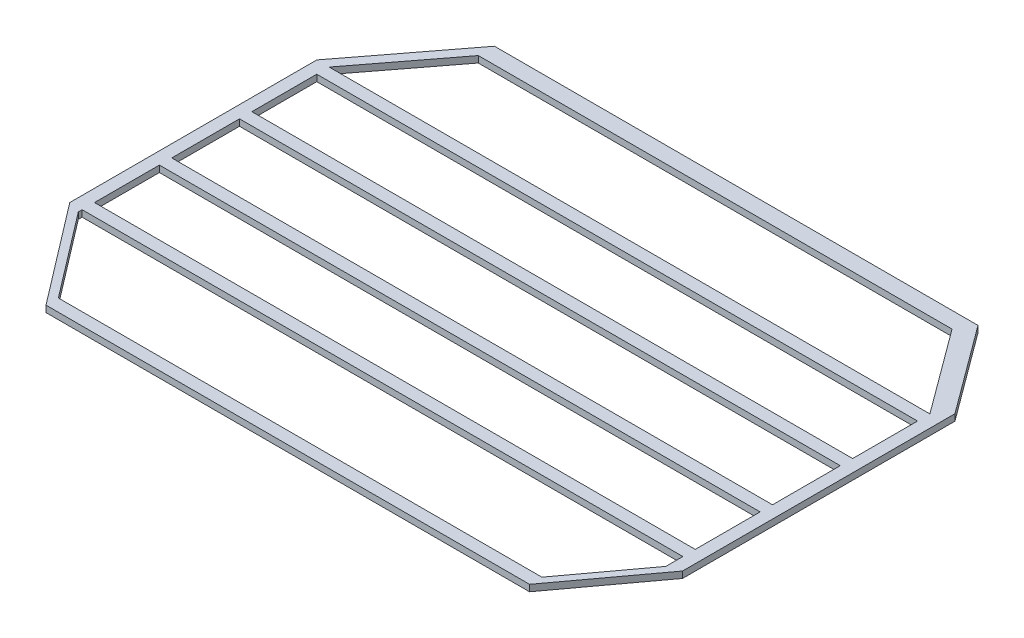
ISO-10303-21;
HEADER;
FILE_DESCRIPTION(('STEP AP214'),'2;1');
FILE_NAME('part.step','',(''),(''),'','','');
FILE_SCHEMA(('AUTOMOTIVE_DESIGN { 1 0 10303 214 1 1 1 1 }'));
ENDSEC;
DATA;
#1=APPLICATION_CONTEXT('core data for automotive mechanical design processes');
#2=APPLICATION_PROTOCOL_DEFINITION('international standard','automotive_design',2000,#1);
#3=PRODUCT_CONTEXT('',#1,'mechanical');
#4=PRODUCT('Part','Part','',(#3));
#5=PRODUCT_RELATED_PRODUCT_CATEGORY('part','',(#4));
#6=PRODUCT_DEFINITION_FORMATION('','',#4);
#7=PRODUCT_DEFINITION_CONTEXT('part definition',#1,'design');
#8=PRODUCT_DEFINITION('design','',#6,#7);
#9=PRODUCT_DEFINITION_SHAPE('','',#8);
#10=(LENGTH_UNIT() NAMED_UNIT(*) SI_UNIT(.MILLI.,.METRE.));
#11=(NAMED_UNIT(*) PLANE_ANGLE_UNIT() SI_UNIT($,.RADIAN.));
#12=(NAMED_UNIT(*) SI_UNIT($,.STERADIAN.) SOLID_ANGLE_UNIT());
#13=UNCERTAINTY_MEASURE_WITH_UNIT(LENGTH_MEASURE(1.E-05),#10,'distance_accuracy_value','');
#14=(GEOMETRIC_REPRESENTATION_CONTEXT(3) GLOBAL_UNCERTAINTY_ASSIGNED_CONTEXT((#13)) GLOBAL_UNIT_ASSIGNED_CONTEXT((#10,
#11,#12)) REPRESENTATION_CONTEXT('',''));
#15=CARTESIAN_POINT('',(0.,0.,0.));
#16=DIRECTION('',(0.,0.,1.));
#17=DIRECTION('',(1.,0.,0.));
#18=AXIS2_PLACEMENT_3D('',#15,#16,#17);
#19=CARTESIAN_POINT('',(19.05,0.,0.));
#20=DIRECTION('',(-1.,0.,0.));
#21=DIRECTION('',(0.,0.,1.));
#22=AXIS2_PLACEMENT_3D('',#19,#20,#21);
#23=PLANE('',#22);
#24=DIRECTION('',(0.,0.,1.));
#25=VECTOR('',#24,1.);
#26=CARTESIAN_POINT('',(19.05,10.,0.));
#27=LINE('',#26,#25);
#28=CARTESIAN_POINT('',(19.05,10.,-52.195));
#29=VERTEX_POINT('',#28);
#30=CARTESIAN_POINT('',(19.05,10.,52.195));
#31=VERTEX_POINT('',#30);
#32=EDGE_CURVE('E169',#29,#31,#27,.T.);
#33=ORIENTED_EDGE('',*,*,#32,.T.);
#34=DIRECTION('',(0.,1.,0.));
#35=VECTOR('',#34,1.);
#36=CARTESIAN_POINT('',(19.05,0.,52.195));
#37=LINE('',#36,#35);
#38=CARTESIAN_POINT('',(19.05,0.,52.195));
#39=VERTEX_POINT('',#38);
#40=EDGE_CURVE('E143',#39,#31,#37,.T.);
#41=ORIENTED_EDGE('',*,*,#40,.F.);
#42=DIRECTION('',(0.,0.,1.));
#43=VECTOR('',#42,1.);
#44=CARTESIAN_POINT('',(19.05,0.,0.));
#45=LINE('',#44,#43);
#46=CARTESIAN_POINT('',(19.05,0.,-52.195));
#47=VERTEX_POINT('',#46);
#48=EDGE_CURVE('E123',#47,#39,#45,.T.);
#49=ORIENTED_EDGE('',*,*,#48,.F.);
#50=DIRECTION('',(0.,1.,0.));
#51=VECTOR('',#50,1.);
#52=CARTESIAN_POINT('',(19.05,0.,-52.195));
#53=LINE('',#52,#51);
#54=EDGE_CURVE('E168',#47,#29,#53,.T.);
#55=ORIENTED_EDGE('',*,*,#54,.T.);
#56=EDGE_LOOP('',(#33,#41,#49,#55));
#57=FACE_BOUND('',#56,.T.);
#58=ADVANCED_FACE('F36',(#57),#23,.F.);
#59=CARTESIAN_POINT('',(0.,0.,-52.195));
#60=DIRECTION('',(0.,0.,1.));
#61=DIRECTION('',(1.,0.,0.));
#62=AXIS2_PLACEMENT_3D('',#59,#60,#61);
#63=PLANE('',#62);
#64=DIRECTION('',(1.,0.,0.));
#65=VECTOR('',#64,1.);
#66=CARTESIAN_POINT('',(0.,10.,-52.195));
#67=LINE('',#66,#65);
#68=CARTESIAN_POINT('',(944.66,10.,-52.195));
#69=VERTEX_POINT('',#68);
#70=EDGE_CURVE('E142',#29,#69,#67,.T.);
#71=ORIENTED_EDGE('',*,*,#70,.F.);
#72=ORIENTED_EDGE('',*,*,#54,.F.);
#73=DIRECTION('',(1.,0.,0.));
#74=VECTOR('',#73,1.);
#75=CARTESIAN_POINT('',(0.,0.,-52.195));
#76=LINE('',#75,#74);
#77=CARTESIAN_POINT('',(944.66,0.,-52.195));
#78=VERTEX_POINT('',#77);
#79=EDGE_CURVE('E164',#47,#78,#76,.T.);
#80=ORIENTED_EDGE('',*,*,#79,.T.);
#81=DIRECTION('',(0.,1.,0.));
#82=VECTOR('',#81,1.);
#83=CARTESIAN_POINT('',(944.66,0.,-52.195));
#84=LINE('',#83,#82);
#85=EDGE_CURVE('E167',#78,#69,#84,.T.);
#86=ORIENTED_EDGE('',*,*,#85,.T.);
#87=EDGE_LOOP('',(#71,#72,#80,#86));
#88=FACE_BOUND('',#87,.T.);
#89=ADVANCED_FACE('F519',(#88),#63,.T.);
#90=CARTESIAN_POINT('',(944.66,0.,0.));
#91=DIRECTION('',(1.,0.,0.));
#92=DIRECTION('',(0.,0.,-1.));
#93=AXIS2_PLACEMENT_3D('',#90,#91,#92);
#94=PLANE('',#93);
#95=DIRECTION('',(0.,0.,-1.));
#96=VECTOR('',#95,1.);
#97=CARTESIAN_POINT('',(944.66,10.,0.));
#98=LINE('',#97,#96);
#99=CARTESIAN_POINT('',(944.66,10.,52.195));
#100=VERTEX_POINT('',#99);
#101=EDGE_CURVE('E176',#100,#69,#98,.T.);
#102=ORIENTED_EDGE('',*,*,#101,.T.);
#103=ORIENTED_EDGE('',*,*,#85,.F.);
#104=DIRECTION('',(0.,0.,-1.));
#105=VECTOR('',#104,1.);
#106=CARTESIAN_POINT('',(944.66,0.,0.));
#107=LINE('',#106,#105);
#108=CARTESIAN_POINT('',(944.66,0.,52.195));
#109=VERTEX_POINT('',#108);
#110=EDGE_CURVE('E160',#109,#78,#107,.T.);
#111=ORIENTED_EDGE('',*,*,#110,.F.);
#112=DIRECTION('',(0.,1.,0.));
#113=VECTOR('',#112,1.);
#114=CARTESIAN_POINT('',(944.66,0.,52.195));
#115=LINE('',#114,#113);
#116=EDGE_CURVE('E175',#109,#100,#115,.T.);
#117=ORIENTED_EDGE('',*,*,#116,.T.);
#118=EDGE_LOOP('',(#102,#103,#111,#117));
#119=FACE_BOUND('',#118,.T.);
#120=ADVANCED_FACE('F524',(#119),#94,.F.);
#121=CARTESIAN_POINT('',(0.,0.,52.195));
#122=DIRECTION('',(0.,0.,1.));
#123=DIRECTION('',(1.,0.,0.));
#124=AXIS2_PLACEMENT_3D('',#121,#122,#123);
#125=PLANE('',#124);
#126=DIRECTION('',(1.,0.,0.));
#127=VECTOR('',#126,1.);
#128=CARTESIAN_POINT('',(0.,10.,52.195));
#129=LINE('',#128,#127);
#130=EDGE_CURVE('E172',#31,#100,#129,.T.);
#131=ORIENTED_EDGE('',*,*,#130,.T.);
#132=ORIENTED_EDGE('',*,*,#116,.F.);
#133=DIRECTION('',(1.,0.,0.));
#134=VECTOR('',#133,1.);
#135=CARTESIAN_POINT('',(0.,0.,52.195));
#136=LINE('',#135,#134);
#137=EDGE_CURVE('E157',#39,#109,#136,.T.);
#138=ORIENTED_EDGE('',*,*,#137,.F.);
#139=ORIENTED_EDGE('',*,*,#40,.T.);
#140=EDGE_LOOP('',(#131,#132,#138,#139));
#141=FACE_BOUND('',#140,.T.);
#142=ADVANCED_FACE('F528',(#141),#125,.F.);
#143=CARTESIAN_POINT('',(0.,10.,0.));
#144=DIRECTION('',(0.,1.,0.));
#145=DIRECTION('',(0.,0.,1.));
#146=AXIS2_PLACEMENT_3D('',#143,#144,#145);
#147=PLANE('',#146);
#148=DIRECTION('',(-1.,0.,0.));
#149=VECTOR('',#148,1.);
#150=CARTESIAN_POINT('',(0.,10.,-320.555846821165));
#151=LINE('',#150,#149);
#152=CARTESIAN_POINT('',(848.514252317726,10.,-320.555846821165));
#153=VERTEX_POINT('',#152);
#154=CARTESIAN_POINT('',(118.58,10.,-320.555846821165));
#155=VERTEX_POINT('',#154);
#156=EDGE_CURVE('E88',#153,#155,#151,.T.);
#157=ORIENTED_EDGE('',*,*,#156,.F.);
#158=DIRECTION('',(-0.593855643200284,0.,-0.804571609640296));
#159=VECTOR('',#158,1.);
#160=CARTESIAN_POINT('',(702.434764912067,10.,-518.468268237294));
#161=LINE('',#160,#159);
#162=CARTESIAN_POINT('',(944.66,10.,-190.295));
#163=VERTEX_POINT('',#162);
#164=EDGE_CURVE('E73',#163,#153,#161,.T.);
#165=ORIENTED_EDGE('',*,*,#164,.F.);
#166=DIRECTION('',(1.,0.,0.));
#167=VECTOR('',#166,1.);
#168=CARTESIAN_POINT('',(0.,10.,-190.295));
#169=LINE('',#168,#167);
#170=CARTESIAN_POINT('',(19.05,10.,-190.295));
#171=VERTEX_POINT('',#170);
#172=EDGE_CURVE('E78',#171,#163,#169,.T.);
#173=ORIENTED_EDGE('',*,*,#172,.F.);
#174=DIRECTION('',(-0.607137371358353,0.,0.794596886666484));
#175=VECTOR('',#174,1.);
#176=CARTESIAN_POINT('',(-79.7760458093183,10.,-60.9554600109612));
#177=LINE('',#176,#175);
#178=EDGE_CURVE('E46',#155,#171,#177,.T.);
#179=ORIENTED_EDGE('',*,*,#178,.F.);
#180=EDGE_LOOP('',(#157,#165,#173,#179));
#181=FACE_BOUND('',#180,.T.);
#182=DIRECTION('',(1.,0.,0.));
#183=VECTOR('',#182,1.);
#184=CARTESIAN_POINT('',(0.,10.,-71.245));
#185=LINE('',#184,#183);
#186=CARTESIAN_POINT('',(19.05,10.,-71.245));
#187=VERTEX_POINT('',#186);
#188=CARTESIAN_POINT('',(944.66,10.,-71.245));
#189=VERTEX_POINT('',#188);
#190=EDGE_CURVE('E131',#187,#189,#185,.T.);
#191=ORIENTED_EDGE('',*,*,#190,.F.);
#192=DIRECTION('',(0.,0.,1.));
#193=VECTOR('',#192,1.);
#194=CARTESIAN_POINT('',(19.05,10.,0.));
#195=LINE('',#194,#193);
#196=CARTESIAN_POINT('',(19.05,10.,-171.245));
#197=VERTEX_POINT('',#196);
#198=EDGE_CURVE('E144',#197,#187,#195,.T.);
#199=ORIENTED_EDGE('',*,*,#198,.F.);
#200=DIRECTION('',(1.,0.,0.));
#201=VECTOR('',#200,1.);
#202=CARTESIAN_POINT('',(0.,10.,-171.245));
#203=LINE('',#202,#201);
#204=CARTESIAN_POINT('',(944.66,10.,-171.245));
#205=VERTEX_POINT('',#204);
#206=EDGE_CURVE('E139',#197,#205,#203,.T.);
#207=ORIENTED_EDGE('',*,*,#206,.T.);
#208=DIRECTION('',(0.,0.,-1.));
#209=VECTOR('',#208,1.);
#210=CARTESIAN_POINT('',(944.66,10.,0.));
#211=LINE('',#210,#209);
#212=EDGE_CURVE('E136',#189,#205,#211,.T.);
#213=ORIENTED_EDGE('',*,*,#212,.F.);
#214=EDGE_LOOP('',(#191,#199,#207,#213));
#215=FACE_BOUND('',#214,.T.);
#216=ORIENTED_EDGE('',*,*,#32,.F.);
#217=ORIENTED_EDGE('',*,*,#70,.T.);
#218=ORIENTED_EDGE('',*,*,#101,.F.);
#219=ORIENTED_EDGE('',*,*,#130,.F.);
#220=EDGE_LOOP('',(#216,#217,#218,#219));
#221=FACE_BOUND('',#220,.T.);
#222=DIRECTION('',(0.,0.,1.));
#223=VECTOR('',#222,1.);
#224=CARTESIAN_POINT('',(19.05,10.,0.));
#225=LINE('',#224,#223);
#226=CARTESIAN_POINT('',(19.05,10.,71.245));
#227=VERTEX_POINT('',#226);
#228=CARTESIAN_POINT('',(19.0500000000001,10.,171.245));
#229=VERTEX_POINT('',#228);
#230=EDGE_CURVE('E204',#227,#229,#225,.T.);
#231=ORIENTED_EDGE('',*,*,#230,.F.);
#232=DIRECTION('',(1.,0.,0.));
#233=VECTOR('',#232,1.);
#234=CARTESIAN_POINT('',(0.,10.,71.245));
#235=LINE('',#234,#233);
#236=CARTESIAN_POINT('',(944.66,10.,71.245));
#237=VERTEX_POINT('',#236);
#238=EDGE_CURVE('E181',#227,#237,#235,.T.);
#239=ORIENTED_EDGE('',*,*,#238,.T.);
#240=DIRECTION('',(0.,0.,-1.));
#241=VECTOR('',#240,1.);
#242=CARTESIAN_POINT('',(944.66,10.,0.));
#243=LINE('',#242,#241);
#244=CARTESIAN_POINT('',(944.66,10.,171.245));
#245=VERTEX_POINT('',#244);
#246=EDGE_CURVE('E212',#245,#237,#243,.T.);
#247=ORIENTED_EDGE('',*,*,#246,.F.);
#248=DIRECTION('',(1.,0.,0.));
#249=VECTOR('',#248,1.);
#250=CARTESIAN_POINT('',(0.,10.,171.245));
#251=LINE('',#250,#249);
#252=EDGE_CURVE('E208',#229,#245,#251,.T.);
#253=ORIENTED_EDGE('',*,*,#252,.F.);
#254=EDGE_LOOP('',(#231,#239,#247,#253));
#255=FACE_BOUND('',#254,.T.);
#256=DIRECTION('',(0.,0.,1.));
#257=VECTOR('',#256,1.);
#258=CARTESIAN_POINT('',(0.,10.,-190.295));
#259=LINE('',#258,#257);
#260=CARTESIAN_POINT('',(0.,10.,-190.295));
#261=VERTEX_POINT('',#260);
#262=CARTESIAN_POINT('',(0.,10.,190.295));
#263=VERTEX_POINT('',#262);
#264=EDGE_CURVE('E217',#261,#263,#259,.T.);
#265=ORIENTED_EDGE('',*,*,#264,.T.);
#266=DIRECTION('',(0.607137371358353,0.,0.794596886666484));
#267=VECTOR('',#266,1.);
#268=CARTESIAN_POINT('',(0.,10.,190.295));
#269=LINE('',#268,#267);
#270=CARTESIAN_POINT('',(118.58,10.,345.487717934831));
#271=VERTEX_POINT('',#270);
#272=EDGE_CURVE('E282',#263,#271,#269,.T.);
#273=ORIENTED_EDGE('',*,*,#272,.T.);
#274=DIRECTION('',(1.,0.,0.));
#275=VECTOR('',#274,1.);
#276=CARTESIAN_POINT('',(118.58,10.,345.487717934831));
#277=LINE('',#276,#275);
#278=CARTESIAN_POINT('',(863.58,10.,345.487717934831));
#279=VERTEX_POINT('',#278);
#280=EDGE_CURVE('E285',#271,#279,#277,.T.);
#281=ORIENTED_EDGE('',*,*,#280,.T.);
#282=DIRECTION('',(0.593855643200284,0.,-0.804571609640296));
#283=VECTOR('',#282,1.);
#284=CARTESIAN_POINT('',(963.71,10.,209.828898833381));
#285=LINE('',#284,#283);
#286=CARTESIAN_POINT('',(963.71,10.,209.828898833381));
#287=VERTEX_POINT('',#286);
#288=EDGE_CURVE('E288',#279,#287,#285,.T.);
#289=ORIENTED_EDGE('',*,*,#288,.T.);
#290=DIRECTION('',(0.,0.,-1.));
#291=VECTOR('',#290,1.);
#292=CARTESIAN_POINT('',(963.71,10.,-209.828898833381));
#293=LINE('',#292,#291);
#294=CARTESIAN_POINT('',(963.71,10.,-209.828898833381));
#295=VERTEX_POINT('',#294);
#296=EDGE_CURVE('E291',#287,#295,#293,.T.);
#297=ORIENTED_EDGE('',*,*,#296,.T.);
#298=DIRECTION('',(-0.593855643200284,0.,-0.804571609640296));
#299=VECTOR('',#298,1.);
#300=CARTESIAN_POINT('',(963.71,10.,-209.828898833381));
#301=LINE('',#300,#299);
#302=CARTESIAN_POINT('',(863.58,10.,-345.487717934831));
#303=VERTEX_POINT('',#302);
#304=EDGE_CURVE('E294',#295,#303,#301,.T.);
#305=ORIENTED_EDGE('',*,*,#304,.T.);
#306=DIRECTION('',(-1.,0.,0.));
#307=VECTOR('',#306,1.);
#308=CARTESIAN_POINT('',(118.58,10.,-345.487717934831));
#309=LINE('',#308,#307);
#310=CARTESIAN_POINT('',(118.58,10.,-345.487717934831));
#311=VERTEX_POINT('',#310);
#312=EDGE_CURVE('E297',#303,#311,#309,.T.);
#313=ORIENTED_EDGE('',*,*,#312,.T.);
#314=DIRECTION('',(-0.607137371358353,0.,0.794596886666484));
#315=VECTOR('',#314,1.);
#316=CARTESIAN_POINT('',(0.,10.,-190.295));
#317=LINE('',#316,#315);
#318=EDGE_CURVE('E248',#311,#261,#317,.T.);
#319=ORIENTED_EDGE('',*,*,#318,.T.);
#320=EDGE_LOOP('',(#265,#273,#281,#289,#297,#305,#313,#319));
#321=FACE_BOUND('',#320,.T.);
#322=DIRECTION('',(0.,0.,1.));
#323=VECTOR('',#322,1.);
#324=CARTESIAN_POINT('',(19.05,10.,0.));
#325=LINE('',#324,#323);
#326=CARTESIAN_POINT('',(19.0500000000001,10.,190.295));
#327=VERTEX_POINT('',#326);
#328=CARTESIAN_POINT('',(19.0500000000001,10.,196.176871113666));
#329=VERTEX_POINT('',#328);
#330=EDGE_CURVE('E249',#327,#329,#325,.T.);
#331=ORIENTED_EDGE('',*,*,#330,.F.);
#332=DIRECTION('',(1.,0.,0.));
#333=VECTOR('',#332,1.);
#334=CARTESIAN_POINT('',(0.,10.,190.295));
#335=LINE('',#334,#333);
#336=CARTESIAN_POINT('',(944.66,10.,190.295));
#337=VERTEX_POINT('',#336);
#338=EDGE_CURVE('E98',#327,#337,#335,.T.);
#339=ORIENTED_EDGE('',*,*,#338,.T.);
#340=DIRECTION('',(0.,0.,-1.));
#341=VECTOR('',#340,1.);
#342=CARTESIAN_POINT('',(944.66,10.,0.));
#343=LINE('',#342,#341);
#344=CARTESIAN_POINT('',(944.66,10.,216.588351583632));
#345=VERTEX_POINT('',#344);
#346=EDGE_CURVE('E265',#345,#337,#343,.T.);
#347=ORIENTED_EDGE('',*,*,#346,.F.);
#348=DIRECTION('',(0.593855643200284,0.,-0.804571609640296));
#349=VECTOR('',#348,1.);
#350=CARTESIAN_POINT('',(714.997712279334,10.,527.741000583163));
#351=LINE('',#350,#349);
#352=CARTESIAN_POINT('',(863.58,10.,326.437717934831));
#353=VERTEX_POINT('',#352);
#354=EDGE_CURVE('E261',#353,#345,#351,.T.);
#355=ORIENTED_EDGE('',*,*,#354,.F.);
#356=DIRECTION('',(1.,0.,0.));
#357=VECTOR('',#356,1.);
#358=CARTESIAN_POINT('',(0.,10.,326.437717934831));
#359=LINE('',#358,#357);
#360=CARTESIAN_POINT('',(118.58,10.,326.437717934831));
#361=VERTEX_POINT('',#360);
#362=EDGE_CURVE('E257',#361,#353,#359,.T.);
#363=ORIENTED_EDGE('',*,*,#362,.F.);
#364=DIRECTION('',(0.607137371358353,0.,0.794596886666484));
#365=VECTOR('',#364,1.);
#366=CARTESIAN_POINT('',(-82.6136337442374,10.,63.1236105646747));
#367=LINE('',#366,#365);
#368=EDGE_CURVE('E253',#329,#361,#367,.T.);
#369=ORIENTED_EDGE('',*,*,#368,.F.);
#370=EDGE_LOOP('',(#331,#339,#347,#355,#363,#369));
#371=FACE_BOUND('',#370,.T.);
#372=ADVANCED_FACE('F85',(#181,#215,#221,#255,#321,#371),#147,.T.);
#373=CARTESIAN_POINT('',(0.,0.,0.));
#374=DIRECTION('',(0.,1.,0.));
#375=DIRECTION('',(0.,0.,1.));
#376=AXIS2_PLACEMENT_3D('',#373,#374,#375);
#377=PLANE('',#376);
#378=DIRECTION('',(-0.593855643200284,0.,-0.804571609640296));
#379=VECTOR('',#378,1.);
#380=CARTESIAN_POINT('',(702.434764912067,0.,-518.468268237294));
#381=LINE('',#380,#379);
#382=CARTESIAN_POINT('',(944.66,0.,-190.295));
#383=VERTEX_POINT('',#382);
#384=CARTESIAN_POINT('',(848.514252317726,0.,-320.555846821165));
#385=VERTEX_POINT('',#384);
#386=EDGE_CURVE('E76',#383,#385,#381,.T.);
#387=ORIENTED_EDGE('',*,*,#386,.T.);
#388=DIRECTION('',(-1.,0.,0.));
#389=VECTOR('',#388,1.);
#390=CARTESIAN_POINT('',(0.,0.,-320.555846821165));
#391=LINE('',#390,#389);
#392=CARTESIAN_POINT('',(118.58,0.,-320.555846821165));
#393=VERTEX_POINT('',#392);
#394=EDGE_CURVE('E40',#385,#393,#391,.T.);
#395=ORIENTED_EDGE('',*,*,#394,.T.);
#396=DIRECTION('',(-0.607137371358353,0.,0.794596886666484));
#397=VECTOR('',#396,1.);
#398=CARTESIAN_POINT('',(-79.7760458093183,0.,-60.9554600109612));
#399=LINE('',#398,#397);
#400=CARTESIAN_POINT('',(19.05,0.,-190.295));
#401=VERTEX_POINT('',#400);
#402=EDGE_CURVE('E101',#393,#401,#399,.T.);
#403=ORIENTED_EDGE('',*,*,#402,.T.);
#404=DIRECTION('',(1.,0.,0.));
#405=VECTOR('',#404,1.);
#406=CARTESIAN_POINT('',(0.,0.,-190.295));
#407=LINE('',#406,#405);
#408=EDGE_CURVE('E99',#401,#383,#407,.T.);
#409=ORIENTED_EDGE('',*,*,#408,.T.);
#410=EDGE_LOOP('',(#387,#395,#403,#409));
#411=FACE_BOUND('',#410,.T.);
#412=DIRECTION('',(0.,0.,1.));
#413=VECTOR('',#412,1.);
#414=CARTESIAN_POINT('',(19.05,0.,0.));
#415=LINE('',#414,#413);
#416=CARTESIAN_POINT('',(19.05,0.,-171.245));
#417=VERTEX_POINT('',#416);
#418=CARTESIAN_POINT('',(19.05,0.,-71.245));
#419=VERTEX_POINT('',#418);
#420=EDGE_CURVE('E100',#417,#419,#415,.T.);
#421=ORIENTED_EDGE('',*,*,#420,.T.);
#422=DIRECTION('',(1.,0.,0.));
#423=VECTOR('',#422,1.);
#424=CARTESIAN_POINT('',(0.,0.,-71.245));
#425=LINE('',#424,#423);
#426=CARTESIAN_POINT('',(944.66,0.,-71.245));
#427=VERTEX_POINT('',#426);
#428=EDGE_CURVE('E117',#419,#427,#425,.T.);
#429=ORIENTED_EDGE('',*,*,#428,.T.);
#430=DIRECTION('',(0.,0.,-1.));
#431=VECTOR('',#430,1.);
#432=CARTESIAN_POINT('',(944.66,0.,0.));
#433=LINE('',#432,#431);
#434=CARTESIAN_POINT('',(944.66,0.,-171.245));
#435=VERTEX_POINT('',#434);
#436=EDGE_CURVE('E120',#427,#435,#433,.T.);
#437=ORIENTED_EDGE('',*,*,#436,.T.);
#438=DIRECTION('',(1.,0.,0.));
#439=VECTOR('',#438,1.);
#440=CARTESIAN_POINT('',(0.,0.,-171.245));
#441=LINE('',#440,#439);
#442=EDGE_CURVE('E124',#417,#435,#441,.T.);
#443=ORIENTED_EDGE('',*,*,#442,.F.);
#444=EDGE_LOOP('',(#421,#429,#437,#443));
#445=FACE_BOUND('',#444,.T.);
#446=ORIENTED_EDGE('',*,*,#79,.F.);
#447=ORIENTED_EDGE('',*,*,#48,.T.);
#448=ORIENTED_EDGE('',*,*,#137,.T.);
#449=ORIENTED_EDGE('',*,*,#110,.T.);
#450=EDGE_LOOP('',(#446,#447,#448,#449));
#451=FACE_BOUND('',#450,.T.);
#452=DIRECTION('',(1.,0.,0.));
#453=VECTOR('',#452,1.);
#454=CARTESIAN_POINT('',(0.,0.,71.245));
#455=LINE('',#454,#453);
#456=CARTESIAN_POINT('',(19.05,0.,71.245));
#457=VERTEX_POINT('',#456);
#458=CARTESIAN_POINT('',(944.66,0.,71.245));
#459=VERTEX_POINT('',#458);
#460=EDGE_CURVE('E199',#457,#459,#455,.T.);
#461=ORIENTED_EDGE('',*,*,#460,.F.);
#462=DIRECTION('',(0.,0.,1.));
#463=VECTOR('',#462,1.);
#464=CARTESIAN_POINT('',(19.05,0.,0.));
#465=LINE('',#464,#463);
#466=CARTESIAN_POINT('',(19.0500000000001,0.,171.245));
#467=VERTEX_POINT('',#466);
#468=EDGE_CURVE('E163',#457,#467,#465,.T.);
#469=ORIENTED_EDGE('',*,*,#468,.T.);
#470=DIRECTION('',(1.,0.,0.));
#471=VECTOR('',#470,1.);
#472=CARTESIAN_POINT('',(0.,0.,171.245));
#473=LINE('',#472,#471);
#474=CARTESIAN_POINT('',(944.66,0.,171.245));
#475=VERTEX_POINT('',#474);
#476=EDGE_CURVE('E192',#467,#475,#473,.T.);
#477=ORIENTED_EDGE('',*,*,#476,.T.);
#478=DIRECTION('',(0.,0.,-1.));
#479=VECTOR('',#478,1.);
#480=CARTESIAN_POINT('',(944.66,0.,0.));
#481=LINE('',#480,#479);
#482=EDGE_CURVE('E195',#475,#459,#481,.T.);
#483=ORIENTED_EDGE('',*,*,#482,.T.);
#484=EDGE_LOOP('',(#461,#469,#477,#483));
#485=FACE_BOUND('',#484,.T.);
#486=DIRECTION('',(0.,0.,1.));
#487=VECTOR('',#486,1.);
#488=CARTESIAN_POINT('',(0.,0.,-190.295));
#489=LINE('',#488,#487);
#490=CARTESIAN_POINT('',(0.,0.,-190.295));
#491=VERTEX_POINT('',#490);
#492=CARTESIAN_POINT('',(0.,0.,190.295));
#493=VERTEX_POINT('',#492);
#494=EDGE_CURVE('E245',#491,#493,#489,.T.);
#495=ORIENTED_EDGE('',*,*,#494,.F.);
#496=DIRECTION('',(-0.607137371358353,0.,0.794596886666484));
#497=VECTOR('',#496,1.);
#498=CARTESIAN_POINT('',(0.,0.,-190.295));
#499=LINE('',#498,#497);
#500=CARTESIAN_POINT('',(118.58,0.,-345.487717934831));
#501=VERTEX_POINT('',#500);
#502=EDGE_CURVE('E329',#501,#491,#499,.T.);
#503=ORIENTED_EDGE('',*,*,#502,.F.);
#504=DIRECTION('',(-1.,0.,0.));
#505=VECTOR('',#504,1.);
#506=CARTESIAN_POINT('',(118.58,0.,-345.487717934831));
#507=LINE('',#506,#505);
#508=CARTESIAN_POINT('',(863.58,0.,-345.487717934831));
#509=VERTEX_POINT('',#508);
#510=EDGE_CURVE('E325',#509,#501,#507,.T.);
#511=ORIENTED_EDGE('',*,*,#510,.F.);
#512=DIRECTION('',(-0.593855643200284,0.,-0.804571609640296));
#513=VECTOR('',#512,1.);
#514=CARTESIAN_POINT('',(963.71,0.,-209.828898833381));
#515=LINE('',#514,#513);
#516=CARTESIAN_POINT('',(963.71,0.,-209.828898833381));
#517=VERTEX_POINT('',#516);
#518=EDGE_CURVE('E321',#517,#509,#515,.T.);
#519=ORIENTED_EDGE('',*,*,#518,.F.);
#520=DIRECTION('',(0.,0.,-1.));
#521=VECTOR('',#520,1.);
#522=CARTESIAN_POINT('',(963.71,0.,-209.828898833381));
#523=LINE('',#522,#521);
#524=CARTESIAN_POINT('',(963.71,0.,209.828898833381));
#525=VERTEX_POINT('',#524);
#526=EDGE_CURVE('E317',#525,#517,#523,.T.);
#527=ORIENTED_EDGE('',*,*,#526,.F.);
#528=DIRECTION('',(0.593855643200284,0.,-0.804571609640296));
#529=VECTOR('',#528,1.);
#530=CARTESIAN_POINT('',(963.71,0.,209.828898833381));
#531=LINE('',#530,#529);
#532=CARTESIAN_POINT('',(863.58,0.,345.487717934831));
#533=VERTEX_POINT('',#532);
#534=EDGE_CURVE('E313',#533,#525,#531,.T.);
#535=ORIENTED_EDGE('',*,*,#534,.F.);
#536=DIRECTION('',(1.,0.,0.));
#537=VECTOR('',#536,1.);
#538=CARTESIAN_POINT('',(118.58,0.,345.487717934831));
#539=LINE('',#538,#537);
#540=CARTESIAN_POINT('',(118.58,0.,345.487717934831));
#541=VERTEX_POINT('',#540);
#542=EDGE_CURVE('E309',#541,#533,#539,.T.);
#543=ORIENTED_EDGE('',*,*,#542,.F.);
#544=DIRECTION('',(0.607137371358353,0.,0.794596886666484));
#545=VECTOR('',#544,1.);
#546=CARTESIAN_POINT('',(0.,0.,190.295));
#547=LINE('',#546,#545);
#548=EDGE_CURVE('E305',#493,#541,#547,.T.);
#549=ORIENTED_EDGE('',*,*,#548,.F.);
#550=EDGE_LOOP('',(#495,#503,#511,#519,#527,#535,#543,#549));
#551=FACE_BOUND('',#550,.T.);
#552=DIRECTION('',(1.,0.,0.));
#553=VECTOR('',#552,1.);
#554=CARTESIAN_POINT('',(0.,0.,190.295));
#555=LINE('',#554,#553);
#556=CARTESIAN_POINT('',(19.0500000000001,0.,190.295));
#557=VERTEX_POINT('',#556);
#558=CARTESIAN_POINT('',(944.66,0.,190.295));
#559=VERTEX_POINT('',#558);
#560=EDGE_CURVE('E226',#557,#559,#555,.T.);
#561=ORIENTED_EDGE('',*,*,#560,.F.);
#562=DIRECTION('',(0.,0.,1.));
#563=VECTOR('',#562,1.);
#564=CARTESIAN_POINT('',(19.05,0.,0.));
#565=LINE('',#564,#563);
#566=CARTESIAN_POINT('',(19.0500000000001,0.,196.176871113666));
#567=VERTEX_POINT('',#566);
#568=EDGE_CURVE('E198',#557,#567,#565,.T.);
#569=ORIENTED_EDGE('',*,*,#568,.T.);
#570=DIRECTION('',(0.607137371358353,0.,0.794596886666484));
#571=VECTOR('',#570,1.);
#572=CARTESIAN_POINT('',(-82.6136337442374,0.,63.1236105646747));
#573=LINE('',#572,#571);
#574=CARTESIAN_POINT('',(118.58,0.,326.437717934831));
#575=VERTEX_POINT('',#574);
#576=EDGE_CURVE('E233',#567,#575,#573,.T.);
#577=ORIENTED_EDGE('',*,*,#576,.T.);
#578=DIRECTION('',(1.,0.,0.));
#579=VECTOR('',#578,1.);
#580=CARTESIAN_POINT('',(0.,0.,326.437717934831));
#581=LINE('',#580,#579);
#582=CARTESIAN_POINT('',(863.58,0.,326.437717934831));
#583=VERTEX_POINT('',#582);
#584=EDGE_CURVE('E236',#575,#583,#581,.T.);
#585=ORIENTED_EDGE('',*,*,#584,.T.);
#586=DIRECTION('',(0.593855643200284,0.,-0.804571609640296));
#587=VECTOR('',#586,1.);
#588=CARTESIAN_POINT('',(714.997712279334,0.,527.741000583163));
#589=LINE('',#588,#587);
#590=CARTESIAN_POINT('',(944.66,0.,216.588351583632));
#591=VERTEX_POINT('',#590);
#592=EDGE_CURVE('E239',#583,#591,#589,.T.);
#593=ORIENTED_EDGE('',*,*,#592,.T.);
#594=DIRECTION('',(0.,0.,-1.));
#595=VECTOR('',#594,1.);
#596=CARTESIAN_POINT('',(944.66,0.,0.));
#597=LINE('',#596,#595);
#598=EDGE_CURVE('E242',#591,#559,#597,.T.);
#599=ORIENTED_EDGE('',*,*,#598,.T.);
#600=EDGE_LOOP('',(#561,#569,#577,#585,#593,#599));
#601=FACE_BOUND('',#600,.T.);
#602=ADVANCED_FACE('F107',(#411,#445,#451,#485,#551,#601),#377,.F.);
#603=CARTESIAN_POINT('',(0.,10.,-190.295));
#604=DIRECTION('',(1.,0.,0.));
#605=DIRECTION('',(0.,0.,-1.));
#606=AXIS2_PLACEMENT_3D('',#603,#604,#605);
#607=PLANE('',#606);
#608=ORIENTED_EDGE('',*,*,#494,.T.);
#609=DIRECTION('',(0.,-1.,0.));
#610=VECTOR('',#609,1.);
#611=CARTESIAN_POINT('',(0.,10.,190.295));
#612=LINE('',#611,#610);
#613=EDGE_CURVE('E308',#263,#493,#612,.T.);
#614=ORIENTED_EDGE('',*,*,#613,.F.);
#615=ORIENTED_EDGE('',*,*,#264,.F.);
#616=DIRECTION('',(0.,-1.,0.));
#617=VECTOR('',#616,1.);
#618=CARTESIAN_POINT('',(0.,10.,-190.295));
#619=LINE('',#618,#617);
#620=EDGE_CURVE('E304',#261,#491,#619,.T.);
#621=ORIENTED_EDGE('',*,*,#620,.T.);
#622=EDGE_LOOP('',(#608,#614,#615,#621));
#623=FACE_BOUND('',#622,.T.);
#624=ADVANCED_FACE('F361',(#623),#607,.F.);
#625=CARTESIAN_POINT('',(0.,10.,190.295));
#626=DIRECTION('',(0.794596886666484,0.,-0.607137371358353));
#627=DIRECTION('',(-0.607137371358353,0.,-0.794596886666484));
#628=AXIS2_PLACEMENT_3D('',#625,#626,#627);
#629=PLANE('',#628);
#630=ORIENTED_EDGE('',*,*,#548,.T.);
#631=DIRECTION('',(0.,-1.,0.));
#632=VECTOR('',#631,1.);
#633=CARTESIAN_POINT('',(118.58,10.,345.487717934831));
#634=LINE('',#633,#632);
#635=EDGE_CURVE('E312',#271,#541,#634,.T.);
#636=ORIENTED_EDGE('',*,*,#635,.F.);
#637=ORIENTED_EDGE('',*,*,#272,.F.);
#638=ORIENTED_EDGE('',*,*,#613,.T.);
#639=EDGE_LOOP('',(#630,#636,#637,#638));
#640=FACE_BOUND('',#639,.T.);
#641=ADVANCED_FACE('F351',(#640),#629,.F.);
#642=CARTESIAN_POINT('',(118.58,10.,345.487717934831));
#643=DIRECTION('',(0.,0.,-1.));
#644=DIRECTION('',(-1.,0.,0.));
#645=AXIS2_PLACEMENT_3D('',#642,#643,#644);
#646=PLANE('',#645);
#647=ORIENTED_EDGE('',*,*,#542,.T.);
#648=DIRECTION('',(0.,-1.,0.));
#649=VECTOR('',#648,1.);
#650=CARTESIAN_POINT('',(863.58,10.,345.487717934831));
#651=LINE('',#650,#649);
#652=EDGE_CURVE('E316',#279,#533,#651,.T.);
#653=ORIENTED_EDGE('',*,*,#652,.F.);
#654=ORIENTED_EDGE('',*,*,#280,.F.);
#655=ORIENTED_EDGE('',*,*,#635,.T.);
#656=EDGE_LOOP('',(#647,#653,#654,#655));
#657=FACE_BOUND('',#656,.T.);
#658=ADVANCED_FACE('F709',(#657),#646,.F.);
#659=CARTESIAN_POINT('',(963.71,10.,209.828898833381));
#660=DIRECTION('',(-0.804571609640296,0.,-0.593855643200284));
#661=DIRECTION('',(-0.593855643200284,0.,0.804571609640296));
#662=AXIS2_PLACEMENT_3D('',#659,#660,#661);
#663=PLANE('',#662);
#664=ORIENTED_EDGE('',*,*,#534,.T.);
#665=DIRECTION('',(0.,-1.,0.));
#666=VECTOR('',#665,1.);
#667=CARTESIAN_POINT('',(963.71,10.,209.828898833381));
#668=LINE('',#667,#666);
#669=EDGE_CURVE('E320',#287,#525,#668,.T.);
#670=ORIENTED_EDGE('',*,*,#669,.F.);
#671=ORIENTED_EDGE('',*,*,#288,.F.);
#672=ORIENTED_EDGE('',*,*,#652,.T.);
#673=EDGE_LOOP('',(#664,#670,#671,#672));
#674=FACE_BOUND('',#673,.T.);
#675=ADVANCED_FACE('F699',(#674),#663,.F.);
#676=CARTESIAN_POINT('',(963.71,10.,-209.828898833381));
#677=DIRECTION('',(-1.,0.,0.));
#678=DIRECTION('',(0.,0.,1.));
#679=AXIS2_PLACEMENT_3D('',#676,#677,#678);
#680=PLANE('',#679);
#681=ORIENTED_EDGE('',*,*,#526,.T.);
#682=DIRECTION('',(0.,-1.,0.));
#683=VECTOR('',#682,1.);
#684=CARTESIAN_POINT('',(963.71,10.,-209.828898833381));
#685=LINE('',#684,#683);
#686=EDGE_CURVE('E324',#295,#517,#685,.T.);
#687=ORIENTED_EDGE('',*,*,#686,.F.);
#688=ORIENTED_EDGE('',*,*,#296,.F.);
#689=ORIENTED_EDGE('',*,*,#669,.T.);
#690=EDGE_LOOP('',(#681,#687,#688,#689));
#691=FACE_BOUND('',#690,.T.);
#692=ADVANCED_FACE('F689',(#691),#680,.F.);
#693=CARTESIAN_POINT('',(963.71,10.,-209.828898833381));
#694=DIRECTION('',(-0.804571609640296,0.,0.593855643200284));
#695=DIRECTION('',(0.593855643200284,0.,0.804571609640296));
#696=AXIS2_PLACEMENT_3D('',#693,#694,#695);
#697=PLANE('',#696);
#698=ORIENTED_EDGE('',*,*,#518,.T.);
#699=DIRECTION('',(0.,-1.,0.));
#700=VECTOR('',#699,1.);
#701=CARTESIAN_POINT('',(863.58,10.,-345.487717934831));
#702=LINE('',#701,#700);
#703=EDGE_CURVE('E328',#303,#509,#702,.T.);
#704=ORIENTED_EDGE('',*,*,#703,.F.);
#705=ORIENTED_EDGE('',*,*,#304,.F.);
#706=ORIENTED_EDGE('',*,*,#686,.T.);
#707=EDGE_LOOP('',(#698,#704,#705,#706));
#708=FACE_BOUND('',#707,.T.);
#709=ADVANCED_FACE('F679',(#708),#697,.F.);
#710=CARTESIAN_POINT('',(118.58,10.,-345.487717934831));
#711=DIRECTION('',(0.,0.,1.));
#712=DIRECTION('',(1.,0.,0.));
#713=AXIS2_PLACEMENT_3D('',#710,#711,#712);
#714=PLANE('',#713);
#715=ORIENTED_EDGE('',*,*,#510,.T.);
#716=DIRECTION('',(0.,-1.,0.));
#717=VECTOR('',#716,1.);
#718=CARTESIAN_POINT('',(118.58,10.,-345.487717934831));
#719=LINE('',#718,#717);
#720=EDGE_CURVE('E230',#311,#501,#719,.T.);
#721=ORIENTED_EDGE('',*,*,#720,.F.);
#722=ORIENTED_EDGE('',*,*,#312,.F.);
#723=ORIENTED_EDGE('',*,*,#703,.T.);
#724=EDGE_LOOP('',(#715,#721,#722,#723));
#725=FACE_BOUND('',#724,.T.);
#726=ADVANCED_FACE('F669',(#725),#714,.F.);
#727=CARTESIAN_POINT('',(0.,10.,-190.295));
#728=DIRECTION('',(0.794596886666484,0.,0.607137371358353));
#729=DIRECTION('',(0.607137371358353,0.,-0.794596886666484));
#730=AXIS2_PLACEMENT_3D('',#727,#728,#729);
#731=PLANE('',#730);
#732=ORIENTED_EDGE('',*,*,#502,.T.);
#733=ORIENTED_EDGE('',*,*,#620,.F.);
#734=ORIENTED_EDGE('',*,*,#318,.F.);
#735=ORIENTED_EDGE('',*,*,#720,.T.);
#736=EDGE_LOOP('',(#732,#733,#734,#735));
#737=FACE_BOUND('',#736,.T.);
#738=ADVANCED_FACE('F658',(#737),#731,.F.);
#739=CARTESIAN_POINT('',(0.,0.,190.295));
#740=DIRECTION('',(0.,0.,1.));
#741=DIRECTION('',(1.,0.,0.));
#742=AXIS2_PLACEMENT_3D('',#739,#740,#741);
#743=PLANE('',#742);
#744=ORIENTED_EDGE('',*,*,#338,.F.);
#745=DIRECTION('',(0.,1.,0.));
#746=VECTOR('',#745,1.);
#747=CARTESIAN_POINT('',(19.0500000000001,0.,190.295));
#748=LINE('',#747,#746);
#749=EDGE_CURVE('E207',#557,#327,#748,.T.);
#750=ORIENTED_EDGE('',*,*,#749,.F.);
#751=ORIENTED_EDGE('',*,*,#560,.T.);
#752=DIRECTION('',(0.,1.,0.));
#753=VECTOR('',#752,1.);
#754=CARTESIAN_POINT('',(944.66,0.,190.295));
#755=LINE('',#754,#753);
#756=EDGE_CURVE('E229',#559,#337,#755,.T.);
#757=ORIENTED_EDGE('',*,*,#756,.T.);
#758=EDGE_LOOP('',(#744,#750,#751,#757));
#759=FACE_BOUND('',#758,.T.);
#760=ADVANCED_FACE('F648',(#759),#743,.T.);
#761=CARTESIAN_POINT('',(944.66,0.,0.));
#762=DIRECTION('',(1.,0.,0.));
#763=DIRECTION('',(0.,0.,-1.));
#764=AXIS2_PLACEMENT_3D('',#761,#762,#763);
#765=PLANE('',#764);
#766=ORIENTED_EDGE('',*,*,#346,.T.);
#767=ORIENTED_EDGE('',*,*,#756,.F.);
#768=ORIENTED_EDGE('',*,*,#598,.F.);
#769=DIRECTION('',(0.,1.,0.));
#770=VECTOR('',#769,1.);
#771=CARTESIAN_POINT('',(944.66,0.,216.588351583632));
#772=LINE('',#771,#770);
#773=EDGE_CURVE('E264',#591,#345,#772,.T.);
#774=ORIENTED_EDGE('',*,*,#773,.T.);
#775=EDGE_LOOP('',(#766,#767,#768,#774));
#776=FACE_BOUND('',#775,.T.);
#777=ADVANCED_FACE('F638',(#776),#765,.F.);
#778=CARTESIAN_POINT('',(714.997712279334,0.,527.741000583163));
#779=DIRECTION('',(0.804571609640296,0.,0.593855643200284));
#780=DIRECTION('',(0.593855643200284,0.,-0.804571609640296));
#781=AXIS2_PLACEMENT_3D('',#778,#779,#780);
#782=PLANE('',#781);
#783=ORIENTED_EDGE('',*,*,#354,.T.);
#784=ORIENTED_EDGE('',*,*,#773,.F.);
#785=ORIENTED_EDGE('',*,*,#592,.F.);
#786=DIRECTION('',(0.,1.,0.));
#787=VECTOR('',#786,1.);
#788=CARTESIAN_POINT('',(863.58,0.,326.437717934831));
#789=LINE('',#788,#787);
#790=EDGE_CURVE('E260',#583,#353,#789,.T.);
#791=ORIENTED_EDGE('',*,*,#790,.T.);
#792=EDGE_LOOP('',(#783,#784,#785,#791));
#793=FACE_BOUND('',#792,.T.);
#794=ADVANCED_FACE('F628',(#793),#782,.F.);
#795=CARTESIAN_POINT('',(0.,0.,326.437717934831));
#796=DIRECTION('',(0.,0.,1.));
#797=DIRECTION('',(1.,0.,0.));
#798=AXIS2_PLACEMENT_3D('',#795,#796,#797);
#799=PLANE('',#798);
#800=ORIENTED_EDGE('',*,*,#362,.T.);
#801=ORIENTED_EDGE('',*,*,#790,.F.);
#802=ORIENTED_EDGE('',*,*,#584,.F.);
#803=DIRECTION('',(0.,1.,0.));
#804=VECTOR('',#803,1.);
#805=CARTESIAN_POINT('',(118.58,0.,326.437717934831));
#806=LINE('',#805,#804);
#807=EDGE_CURVE('E256',#575,#361,#806,.T.);
#808=ORIENTED_EDGE('',*,*,#807,.T.);
#809=EDGE_LOOP('',(#800,#801,#802,#808));
#810=FACE_BOUND('',#809,.T.);
#811=ADVANCED_FACE('F618',(#810),#799,.F.);
#812=CARTESIAN_POINT('',(-82.6136337442374,0.,63.1236105646747));
#813=DIRECTION('',(-0.794596886666484,0.,0.607137371358353));
#814=DIRECTION('',(0.607137371358353,0.,0.794596886666484));
#815=AXIS2_PLACEMENT_3D('',#812,#813,#814);
#816=PLANE('',#815);
#817=ORIENTED_EDGE('',*,*,#368,.T.);
#818=ORIENTED_EDGE('',*,*,#807,.F.);
#819=ORIENTED_EDGE('',*,*,#576,.F.);
#820=DIRECTION('',(0.,1.,0.));
#821=VECTOR('',#820,1.);
#822=CARTESIAN_POINT('',(19.0500000000001,0.,196.176871113666));
#823=LINE('',#822,#821);
#824=EDGE_CURVE('E252',#567,#329,#823,.T.);
#825=ORIENTED_EDGE('',*,*,#824,.T.);
#826=EDGE_LOOP('',(#817,#818,#819,#825));
#827=FACE_BOUND('',#826,.T.);
#828=ADVANCED_FACE('F608',(#827),#816,.F.);
#829=CARTESIAN_POINT('',(19.05,0.,0.));
#830=DIRECTION('',(-1.,0.,0.));
#831=DIRECTION('',(0.,0.,1.));
#832=AXIS2_PLACEMENT_3D('',#829,#830,#831);
#833=PLANE('',#832);
#834=ORIENTED_EDGE('',*,*,#330,.T.);
#835=ORIENTED_EDGE('',*,*,#824,.F.);
#836=ORIENTED_EDGE('',*,*,#568,.F.);
#837=ORIENTED_EDGE('',*,*,#749,.T.);
#838=EDGE_LOOP('',(#834,#835,#836,#837));
#839=FACE_BOUND('',#838,.T.);
#840=ADVANCED_FACE('F515',(#839),#833,.F.);
#841=CARTESIAN_POINT('',(19.05,0.,0.));
#842=DIRECTION('',(-1.,0.,0.));
#843=DIRECTION('',(0.,0.,1.));
#844=AXIS2_PLACEMENT_3D('',#841,#842,#843);
#845=PLANE('',#844);
#846=ORIENTED_EDGE('',*,*,#230,.T.);
#847=DIRECTION('',(0.,1.,0.));
#848=VECTOR('',#847,1.);
#849=CARTESIAN_POINT('',(19.0500000000001,0.,171.245));
#850=LINE('',#849,#848);
#851=EDGE_CURVE('E135',#467,#229,#850,.T.);
#852=ORIENTED_EDGE('',*,*,#851,.F.);
#853=ORIENTED_EDGE('',*,*,#468,.F.);
#854=DIRECTION('',(0.,1.,0.));
#855=VECTOR('',#854,1.);
#856=CARTESIAN_POINT('',(19.05,0.,71.245));
#857=LINE('',#856,#855);
#858=EDGE_CURVE('E203',#457,#227,#857,.T.);
#859=ORIENTED_EDGE('',*,*,#858,.T.);
#860=EDGE_LOOP('',(#846,#852,#853,#859));
#861=FACE_BOUND('',#860,.T.);
#862=ADVANCED_FACE('F501',(#861),#845,.F.);
#863=CARTESIAN_POINT('',(0.,0.,71.245));
#864=DIRECTION('',(0.,0.,1.));
#865=DIRECTION('',(1.,0.,0.));
#866=AXIS2_PLACEMENT_3D('',#863,#864,#865);
#867=PLANE('',#866);
#868=ORIENTED_EDGE('',*,*,#238,.F.);
#869=ORIENTED_EDGE('',*,*,#858,.F.);
#870=ORIENTED_EDGE('',*,*,#460,.T.);
#871=DIRECTION('',(0.,1.,0.));
#872=VECTOR('',#871,1.);
#873=CARTESIAN_POINT('',(944.66,0.,71.245));
#874=LINE('',#873,#872);
#875=EDGE_CURVE('E202',#459,#237,#874,.T.);
#876=ORIENTED_EDGE('',*,*,#875,.T.);
#877=EDGE_LOOP('',(#868,#869,#870,#876));
#878=FACE_BOUND('',#877,.T.);
#879=ADVANCED_FACE('F507',(#878),#867,.T.);
#880=CARTESIAN_POINT('',(944.66,0.,0.));
#881=DIRECTION('',(1.,0.,0.));
#882=DIRECTION('',(0.,0.,-1.));
#883=AXIS2_PLACEMENT_3D('',#880,#881,#882);
#884=PLANE('',#883);
#885=ORIENTED_EDGE('',*,*,#246,.T.);
#886=ORIENTED_EDGE('',*,*,#875,.F.);
#887=ORIENTED_EDGE('',*,*,#482,.F.);
#888=DIRECTION('',(0.,1.,0.));
#889=VECTOR('',#888,1.);
#890=CARTESIAN_POINT('',(944.66,0.,171.245));
#891=LINE('',#890,#889);
#892=EDGE_CURVE('E211',#475,#245,#891,.T.);
#893=ORIENTED_EDGE('',*,*,#892,.T.);
#894=EDGE_LOOP('',(#885,#886,#887,#893));
#895=FACE_BOUND('',#894,.T.);
#896=ADVANCED_FACE('F491',(#895),#884,.F.);
#897=CARTESIAN_POINT('',(0.,0.,171.245));
#898=DIRECTION('',(0.,0.,1.));
#899=DIRECTION('',(1.,0.,0.));
#900=AXIS2_PLACEMENT_3D('',#897,#898,#899);
#901=PLANE('',#900);
#902=ORIENTED_EDGE('',*,*,#252,.T.);
#903=ORIENTED_EDGE('',*,*,#892,.F.);
#904=ORIENTED_EDGE('',*,*,#476,.F.);
#905=ORIENTED_EDGE('',*,*,#851,.T.);
#906=EDGE_LOOP('',(#902,#903,#904,#905));
#907=FACE_BOUND('',#906,.T.);
#908=ADVANCED_FACE('F496',(#907),#901,.F.);
#909=CARTESIAN_POINT('',(0.,0.,-71.245));
#910=DIRECTION('',(0.,0.,1.));
#911=DIRECTION('',(1.,0.,0.));
#912=AXIS2_PLACEMENT_3D('',#909,#910,#911);
#913=PLANE('',#912);
#914=ORIENTED_EDGE('',*,*,#190,.T.);
#915=DIRECTION('',(0.,1.,0.));
#916=VECTOR('',#915,1.);
#917=CARTESIAN_POINT('',(944.66,0.,-71.245));
#918=LINE('',#917,#916);
#919=EDGE_CURVE('E96',#427,#189,#918,.T.);
#920=ORIENTED_EDGE('',*,*,#919,.F.);
#921=ORIENTED_EDGE('',*,*,#428,.F.);
#922=DIRECTION('',(0.,1.,0.));
#923=VECTOR('',#922,1.);
#924=CARTESIAN_POINT('',(19.05,0.,-71.245));
#925=LINE('',#924,#923);
#926=EDGE_CURVE('E134',#419,#187,#925,.T.);
#927=ORIENTED_EDGE('',*,*,#926,.T.);
#928=EDGE_LOOP('',(#914,#920,#921,#927));
#929=FACE_BOUND('',#928,.T.);
#930=ADVANCED_FACE('F535',(#929),#913,.F.);
#931=CARTESIAN_POINT('',(19.05,0.,0.));
#932=DIRECTION('',(-1.,0.,0.));
#933=DIRECTION('',(0.,0.,1.));
#934=AXIS2_PLACEMENT_3D('',#931,#932,#933);
#935=PLANE('',#934);
#936=ORIENTED_EDGE('',*,*,#198,.T.);
#937=ORIENTED_EDGE('',*,*,#926,.F.);
#938=ORIENTED_EDGE('',*,*,#420,.F.);
#939=DIRECTION('',(0.,1.,0.));
#940=VECTOR('',#939,1.);
#941=CARTESIAN_POINT('',(19.05,0.,-171.245));
#942=LINE('',#941,#940);
#943=EDGE_CURVE('E128',#417,#197,#942,.T.);
#944=ORIENTED_EDGE('',*,*,#943,.T.);
#945=EDGE_LOOP('',(#936,#937,#938,#944));
#946=FACE_BOUND('',#945,.T.);
#947=ADVANCED_FACE('F538',(#946),#935,.F.);
#948=CARTESIAN_POINT('',(0.,0.,-171.245));
#949=DIRECTION('',(0.,0.,1.));
#950=DIRECTION('',(1.,0.,0.));
#951=AXIS2_PLACEMENT_3D('',#948,#949,#950);
#952=PLANE('',#951);
#953=ORIENTED_EDGE('',*,*,#206,.F.);
#954=ORIENTED_EDGE('',*,*,#943,.F.);
#955=ORIENTED_EDGE('',*,*,#442,.T.);
#956=DIRECTION('',(0.,1.,0.));
#957=VECTOR('',#956,1.);
#958=CARTESIAN_POINT('',(944.66,0.,-171.245));
#959=LINE('',#958,#957);
#960=EDGE_CURVE('E127',#435,#205,#959,.T.);
#961=ORIENTED_EDGE('',*,*,#960,.T.);
#962=EDGE_LOOP('',(#953,#954,#955,#961));
#963=FACE_BOUND('',#962,.T.);
#964=ADVANCED_FACE('F542',(#963),#952,.T.);
#965=CARTESIAN_POINT('',(944.66,0.,0.));
#966=DIRECTION('',(1.,0.,0.));
#967=DIRECTION('',(0.,0.,-1.));
#968=AXIS2_PLACEMENT_3D('',#965,#966,#967);
#969=PLANE('',#968);
#970=ORIENTED_EDGE('',*,*,#212,.T.);
#971=ORIENTED_EDGE('',*,*,#960,.F.);
#972=ORIENTED_EDGE('',*,*,#436,.F.);
#973=ORIENTED_EDGE('',*,*,#919,.T.);
#974=EDGE_LOOP('',(#970,#971,#972,#973));
#975=FACE_BOUND('',#974,.T.);
#976=ADVANCED_FACE('F539',(#975),#969,.F.);
#977=CARTESIAN_POINT('',(0.,0.,-320.555846821165));
#978=DIRECTION('',(0.,0.,-1.));
#979=DIRECTION('',(-1.,0.,0.));
#980=AXIS2_PLACEMENT_3D('',#977,#978,#979);
#981=PLANE('',#980);
#982=ORIENTED_EDGE('',*,*,#156,.T.);
#983=DIRECTION('',(0.,1.,0.));
#984=VECTOR('',#983,1.);
#985=CARTESIAN_POINT('',(118.58,0.,-320.555846821165));
#986=LINE('',#985,#984);
#987=EDGE_CURVE('E11',#393,#155,#986,.T.);
#988=ORIENTED_EDGE('',*,*,#987,.F.);
#989=ORIENTED_EDGE('',*,*,#394,.F.);
#990=DIRECTION('',(0.,1.,0.));
#991=VECTOR('',#990,1.);
#992=CARTESIAN_POINT('',(848.514252317726,0.,-320.555846821165));
#993=LINE('',#992,#991);
#994=EDGE_CURVE('E89',#385,#153,#993,.T.);
#995=ORIENTED_EDGE('',*,*,#994,.T.);
#996=EDGE_LOOP('',(#982,#988,#989,#995));
#997=FACE_BOUND('',#996,.T.);
#998=ADVANCED_FACE('F112',(#997),#981,.F.);
#999=CARTESIAN_POINT('',(702.434764912067,0.,-518.468268237294));
#1000=DIRECTION('',(0.804571609640296,0.,-0.593855643200284));
#1001=DIRECTION('',(-0.593855643200284,0.,-0.804571609640296));
#1002=AXIS2_PLACEMENT_3D('',#999,#1000,#1001);
#1003=PLANE('',#1002);
#1004=ORIENTED_EDGE('',*,*,#164,.T.);
#1005=ORIENTED_EDGE('',*,*,#994,.F.);
#1006=ORIENTED_EDGE('',*,*,#386,.F.);
#1007=DIRECTION('',(0.,1.,0.));
#1008=VECTOR('',#1007,1.);
#1009=CARTESIAN_POINT('',(944.66,0.,-190.295));
#1010=LINE('',#1009,#1008);
#1011=EDGE_CURVE('E68',#383,#163,#1010,.T.);
#1012=ORIENTED_EDGE('',*,*,#1011,.T.);
#1013=EDGE_LOOP('',(#1004,#1005,#1006,#1012));
#1014=FACE_BOUND('',#1013,.T.);
#1015=ADVANCED_FACE('F38',(#1014),#1003,.F.);
#1016=CARTESIAN_POINT('',(0.,0.,-190.295));
#1017=DIRECTION('',(0.,0.,1.));
#1018=DIRECTION('',(1.,0.,0.));
#1019=AXIS2_PLACEMENT_3D('',#1016,#1017,#1018);
#1020=PLANE('',#1019);
#1021=ORIENTED_EDGE('',*,*,#172,.T.);
#1022=ORIENTED_EDGE('',*,*,#1011,.F.);
#1023=ORIENTED_EDGE('',*,*,#408,.F.);
#1024=DIRECTION('',(0.,1.,0.));
#1025=VECTOR('',#1024,1.);
#1026=CARTESIAN_POINT('',(19.05,0.,-190.295));
#1027=LINE('',#1026,#1025);
#1028=EDGE_CURVE('E55',#401,#171,#1027,.T.);
#1029=ORIENTED_EDGE('',*,*,#1028,.T.);
#1030=EDGE_LOOP('',(#1021,#1022,#1023,#1029));
#1031=FACE_BOUND('',#1030,.T.);
#1032=ADVANCED_FACE('F81',(#1031),#1020,.F.);
#1033=CARTESIAN_POINT('',(-79.7760458093183,0.,-60.9554600109612));
#1034=DIRECTION('',(-0.794596886666484,0.,-0.607137371358353));
#1035=DIRECTION('',(-0.607137371358353,0.,0.794596886666484));
#1036=AXIS2_PLACEMENT_3D('',#1033,#1034,#1035);
#1037=PLANE('',#1036);
#1038=ORIENTED_EDGE('',*,*,#178,.T.);
#1039=ORIENTED_EDGE('',*,*,#1028,.F.);
#1040=ORIENTED_EDGE('',*,*,#402,.F.);
#1041=ORIENTED_EDGE('',*,*,#987,.T.);
#1042=EDGE_LOOP('',(#1038,#1039,#1040,#1041));
#1043=FACE_BOUND('',#1042,.T.);
#1044=ADVANCED_FACE('F114',(#1043),#1037,.F.);
#1045=CLOSED_SHELL('',(#58,#89,#120,#142,#372,#602,#624,#641,#658,#675,#692,#709,#726,#738,#760,
#777,#794,#811,#828,#840,#862,#879,#896,#908,#930,#947,#964,#976,#998,#1015,#1032,#1044));
#1046=MANIFOLD_SOLID_BREP('B2',#1045);
#1047=ADVANCED_BREP_SHAPE_REPRESENTATION('',(#18,#1046),#14);
#1048=SHAPE_DEFINITION_REPRESENTATION(#9,#1047);
ENDSEC;
END-ISO-10303-21;
